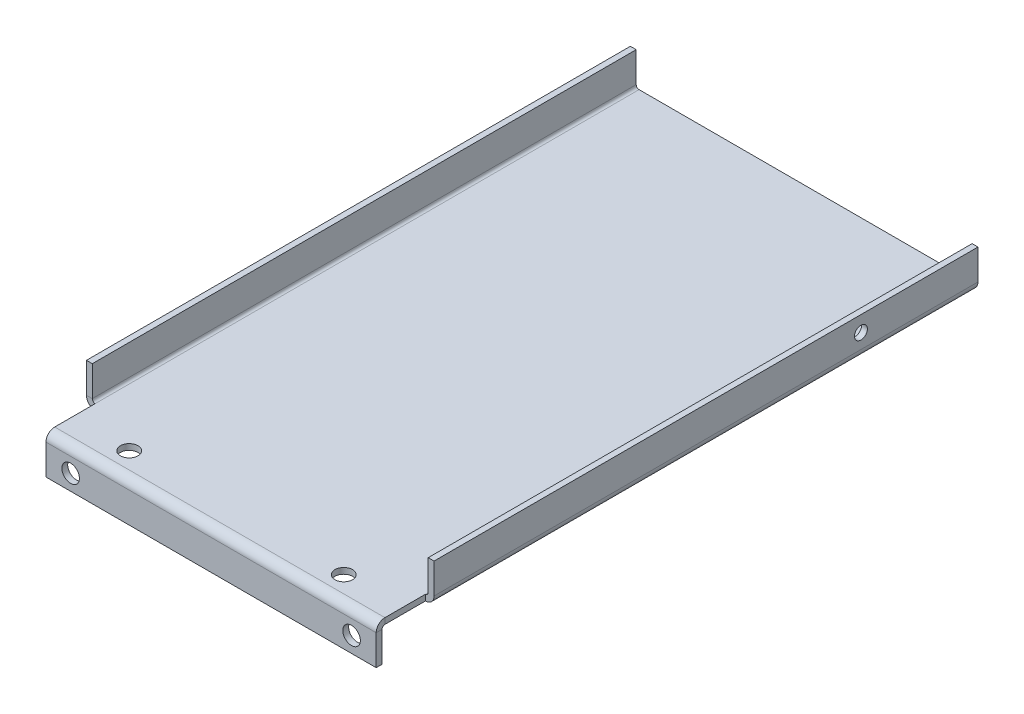
ISO-10303-21;
HEADER;
FILE_DESCRIPTION(('STEP AP214'),'2;1');
FILE_NAME('part.step','',(''),(''),'','','');
FILE_SCHEMA(('AUTOMOTIVE_DESIGN { 1 0 10303 214 1 1 1 1 }'));
ENDSEC;
DATA;
#1=APPLICATION_CONTEXT('core data for automotive mechanical design processes');
#2=APPLICATION_PROTOCOL_DEFINITION('international standard','automotive_design',2000,#1);
#3=PRODUCT_CONTEXT('',#1,'mechanical');
#4=PRODUCT('Part','Part','',(#3));
#5=PRODUCT_RELATED_PRODUCT_CATEGORY('part','',(#4));
#6=PRODUCT_DEFINITION_FORMATION('','',#4);
#7=PRODUCT_DEFINITION_CONTEXT('part definition',#1,'design');
#8=PRODUCT_DEFINITION('design','',#6,#7);
#9=PRODUCT_DEFINITION_SHAPE('','',#8);
#10=(LENGTH_UNIT() NAMED_UNIT(*) SI_UNIT(.MILLI.,.METRE.));
#11=(NAMED_UNIT(*) PLANE_ANGLE_UNIT() SI_UNIT($,.RADIAN.));
#12=(NAMED_UNIT(*) SI_UNIT($,.STERADIAN.) SOLID_ANGLE_UNIT());
#13=UNCERTAINTY_MEASURE_WITH_UNIT(LENGTH_MEASURE(1.E-05),#10,'distance_accuracy_value','');
#14=(GEOMETRIC_REPRESENTATION_CONTEXT(3) GLOBAL_UNCERTAINTY_ASSIGNED_CONTEXT((#13)) GLOBAL_UNIT_ASSIGNED_CONTEXT((#10,
#11,#12)) REPRESENTATION_CONTEXT('',''));
#15=CARTESIAN_POINT('',(0.,0.,0.));
#16=DIRECTION('',(0.,0.,1.));
#17=DIRECTION('',(1.,0.,0.));
#18=AXIS2_PLACEMENT_3D('',#15,#16,#17);
#19=CARTESIAN_POINT('',(0.,-1.5,152.));
#20=DIRECTION('',(0.,1.,0.));
#21=DIRECTION('',(0.,0.,1.));
#22=AXIS2_PLACEMENT_3D('',#19,#20,#21);
#23=PLANE('',#22);
#24=CARTESIAN_POINT('',(72.05,-1.5,145.5));
#25=DIRECTION('',(0.,-1.,0.));
#26=DIRECTION('',(0.,0.,1.));
#27=AXIS2_PLACEMENT_3D('',#24,#25,#26);
#28=CIRCLE('',#27,2.25);
#29=CARTESIAN_POINT('',(72.05,-1.5,147.75));
#30=VERTEX_POINT('',#29);
#31=EDGE_CURVE('E420',#30,#30,#28,.T.);
#32=ORIENTED_EDGE('',*,*,#31,.F.);
#33=EDGE_LOOP('',(#32));
#34=FACE_BOUND('',#33,.T.);
#35=CARTESIAN_POINT('',(17.05,-1.5,145.5));
#36=DIRECTION('',(0.,-1.,0.));
#37=DIRECTION('',(0.,0.,-1.));
#38=AXIS2_PLACEMENT_3D('',#35,#36,#37);
#39=CIRCLE('',#38,2.25);
#40=CARTESIAN_POINT('',(17.05,-1.5,143.25));
#41=VERTEX_POINT('',#40);
#42=EDGE_CURVE('E410',#41,#41,#39,.T.);
#43=ORIENTED_EDGE('',*,*,#42,.F.);
#44=EDGE_LOOP('',(#43));
#45=FACE_BOUND('',#44,.T.);
#46=DIRECTION('',(-1.,0.,0.));
#47=VECTOR('',#46,1.);
#48=CARTESIAN_POINT('',(2.23659999999999,-1.5,149.7634));
#49=LINE('',#48,#47);
#50=CARTESIAN_POINT('',(2.23659999999999,-1.5,149.7634));
#51=VERTEX_POINT('',#50);
#52=CARTESIAN_POINT('',(86.8634,-1.5,149.7634));
#53=VERTEX_POINT('',#52);
#54=EDGE_CURVE('E287',#51,#53,#49,.F.);
#55=ORIENTED_EDGE('',*,*,#54,.F.);
#56=DIRECTION('',(0.,0.,1.));
#57=VECTOR('',#56,1.);
#58=CARTESIAN_POINT('',(2.2366,-1.5,152.));
#59=LINE('',#58,#57);
#60=CARTESIAN_POINT('',(2.2366,-1.5,139.4));
#61=VERTEX_POINT('',#60);
#62=EDGE_CURVE('E380',#51,#61,#59,.F.);
#63=ORIENTED_EDGE('',*,*,#62,.T.);
#64=CARTESIAN_POINT('',(2.2366,-1.5,0.));
#65=VERTEX_POINT('',#64);
#66=EDGE_CURVE('E383',#61,#65,#59,.F.);
#67=ORIENTED_EDGE('',*,*,#66,.T.);
#68=DIRECTION('',(1.,0.,0.));
#69=VECTOR('',#68,1.);
#70=CARTESIAN_POINT('',(0.,-1.5,0.));
#71=LINE('',#70,#69);
#72=CARTESIAN_POINT('',(86.8634,-1.5,0.));
#73=VERTEX_POINT('',#72);
#74=EDGE_CURVE('E394',#65,#73,#71,.T.);
#75=ORIENTED_EDGE('',*,*,#74,.T.);
#76=DIRECTION('',(0.,0.,-1.));
#77=VECTOR('',#76,1.);
#78=CARTESIAN_POINT('',(86.8634,-1.5,0.));
#79=LINE('',#78,#77);
#80=CARTESIAN_POINT('',(86.8634,-1.5,139.4));
#81=VERTEX_POINT('',#80);
#82=EDGE_CURVE('E342',#73,#81,#79,.F.);
#83=ORIENTED_EDGE('',*,*,#82,.T.);
#84=DIRECTION('',(0.,0.,-1.));
#85=VECTOR('',#84,1.);
#86=CARTESIAN_POINT('',(86.8634,-1.5,152.));
#87=LINE('',#86,#85);
#88=EDGE_CURVE('E293',#53,#81,#87,.T.);
#89=ORIENTED_EDGE('',*,*,#88,.F.);
#90=EDGE_LOOP('',(#55,#63,#67,#75,#83,#89));
#91=FACE_BOUND('',#90,.T.);
#92=ADVANCED_FACE('F101',(#34,#45,#91),#23,.F.);
#93=CARTESIAN_POINT('',(0.,0.,152.));
#94=DIRECTION('',(0.,1.,0.));
#95=DIRECTION('',(0.,0.,1.));
#96=AXIS2_PLACEMENT_3D('',#93,#94,#95);
#97=PLANE('',#96);
#98=CARTESIAN_POINT('',(72.05,0.,145.5));
#99=DIRECTION('',(0.,1.,0.));
#100=DIRECTION('',(0.,0.,1.));
#101=AXIS2_PLACEMENT_3D('',#98,#99,#100);
#102=CIRCLE('',#101,2.25);
#103=CARTESIAN_POINT('',(72.05,0.,147.75));
#104=VERTEX_POINT('',#103);
#105=EDGE_CURVE('E104',#104,#104,#102,.T.);
#106=ORIENTED_EDGE('',*,*,#105,.F.);
#107=EDGE_LOOP('',(#106));
#108=FACE_BOUND('',#107,.T.);
#109=CARTESIAN_POINT('',(17.05,0.,145.5));
#110=DIRECTION('',(0.,1.,0.));
#111=DIRECTION('',(0.,0.,1.));
#112=AXIS2_PLACEMENT_3D('',#109,#110,#111);
#113=CIRCLE('',#112,2.25);
#114=CARTESIAN_POINT('',(17.05,0.,147.75));
#115=VERTEX_POINT('',#114);
#116=EDGE_CURVE('E408',#115,#115,#113,.T.);
#117=ORIENTED_EDGE('',*,*,#116,.F.);
#118=EDGE_LOOP('',(#117));
#119=FACE_BOUND('',#118,.T.);
#120=DIRECTION('',(0.,0.,1.));
#121=VECTOR('',#120,1.);
#122=CARTESIAN_POINT('',(2.2366,0.,152.));
#123=LINE('',#122,#121);
#124=CARTESIAN_POINT('',(2.23659999999999,0.,149.7634));
#125=VERTEX_POINT('',#124);
#126=CARTESIAN_POINT('',(2.2366,0.,139.4));
#127=VERTEX_POINT('',#126);
#128=EDGE_CURVE('E390',#125,#127,#123,.F.);
#129=ORIENTED_EDGE('',*,*,#128,.F.);
#130=DIRECTION('',(-1.,0.,0.));
#131=VECTOR('',#130,1.);
#132=CARTESIAN_POINT('',(2.23659999999999,0.,149.7634));
#133=LINE('',#132,#131);
#134=CARTESIAN_POINT('',(86.8634,0.,149.7634));
#135=VERTEX_POINT('',#134);
#136=EDGE_CURVE('E232',#125,#135,#133,.F.);
#137=ORIENTED_EDGE('',*,*,#136,.T.);
#138=DIRECTION('',(0.,0.,-1.));
#139=VECTOR('',#138,1.);
#140=CARTESIAN_POINT('',(86.8634,0.,0.));
#141=LINE('',#140,#139);
#142=CARTESIAN_POINT('',(86.8634,0.,139.4));
#143=VERTEX_POINT('',#142);
#144=EDGE_CURVE('E352',#143,#135,#141,.F.);
#145=ORIENTED_EDGE('',*,*,#144,.F.);
#146=CARTESIAN_POINT('',(86.8634,0.,0.));
#147=VERTEX_POINT('',#146);
#148=EDGE_CURVE('E349',#147,#143,#141,.F.);
#149=ORIENTED_EDGE('',*,*,#148,.F.);
#150=DIRECTION('',(1.,0.,0.));
#151=VECTOR('',#150,1.);
#152=CARTESIAN_POINT('',(0.,0.,0.));
#153=LINE('',#152,#151);
#154=CARTESIAN_POINT('',(2.2366,0.,0.));
#155=VERTEX_POINT('',#154);
#156=EDGE_CURVE('E396',#155,#147,#153,.T.);
#157=ORIENTED_EDGE('',*,*,#156,.F.);
#158=EDGE_CURVE('E361',#127,#155,#123,.F.);
#159=ORIENTED_EDGE('',*,*,#158,.F.);
#160=EDGE_LOOP('',(#129,#137,#145,#149,#157,#159));
#161=FACE_BOUND('',#160,.T.);
#162=ADVANCED_FACE('F495',(#108,#119,#161),#97,.T.);
#163=CARTESIAN_POINT('',(2.2366,8.50000000000001,152.));
#164=DIRECTION('',(1.,0.,0.));
#165=DIRECTION('',(0.,0.,-1.));
#166=AXIS2_PLACEMENT_3D('',#163,#164,#165);
#167=PLANE('',#166);
#168=DIRECTION('',(0.,1.,0.));
#169=VECTOR('',#168,1.);
#170=CARTESIAN_POINT('',(2.23659999999999,-1.5,149.7634));
#171=LINE('',#170,#169);
#172=EDGE_CURVE('E283',#51,#125,#171,.T.);
#173=ORIENTED_EDGE('',*,*,#172,.T.);
#174=ORIENTED_EDGE('',*,*,#128,.T.);
#175=DIRECTION('',(0.,-1.,0.));
#176=VECTOR('',#175,1.);
#177=CARTESIAN_POINT('',(2.2366,8.50000000000001,139.4));
#178=LINE('',#177,#176);
#179=EDGE_CURVE('E308',#127,#61,#178,.T.);
#180=ORIENTED_EDGE('',*,*,#179,.T.);
#181=ORIENTED_EDGE('',*,*,#62,.F.);
#182=EDGE_LOOP('',(#173,#174,#180,#181));
#183=FACE_BOUND('',#182,.T.);
#184=ADVANCED_FACE('F446',(#183),#167,.F.);
#185=CARTESIAN_POINT('',(86.8634,8.50000000000001,152.));
#186=DIRECTION('',(-1.,0.,0.));
#187=DIRECTION('',(0.,0.,1.));
#188=AXIS2_PLACEMENT_3D('',#185,#186,#187);
#189=PLANE('',#188);
#190=DIRECTION('',(0.,1.,0.));
#191=VECTOR('',#190,1.);
#192=CARTESIAN_POINT('',(86.8634,-1.5,149.7634));
#193=LINE('',#192,#191);
#194=EDGE_CURVE('E290',#53,#135,#193,.T.);
#195=ORIENTED_EDGE('',*,*,#194,.F.);
#196=ORIENTED_EDGE('',*,*,#88,.T.);
#197=DIRECTION('',(0.,-1.,0.));
#198=VECTOR('',#197,1.);
#199=CARTESIAN_POINT('',(86.8634,8.50000000000001,139.4));
#200=LINE('',#199,#198);
#201=EDGE_CURVE('E296',#143,#81,#200,.T.);
#202=ORIENTED_EDGE('',*,*,#201,.F.);
#203=ORIENTED_EDGE('',*,*,#144,.T.);
#204=EDGE_LOOP('',(#195,#196,#202,#203));
#205=FACE_BOUND('',#204,.T.);
#206=ADVANCED_FACE('F549',(#205),#189,.F.);
#207=CARTESIAN_POINT('',(2.2366,8.50000000000001,139.4));
#208=DIRECTION('',(0.,0.,-1.));
#209=DIRECTION('',(-1.,0.,0.));
#210=AXIS2_PLACEMENT_3D('',#207,#208,#209);
#211=PLANE('',#210);
#212=DIRECTION('',(0.,-1.,0.));
#213=VECTOR('',#212,1.);
#214=CARTESIAN_POINT('',(0.,0.,139.4));
#215=LINE('',#214,#213);
#216=CARTESIAN_POINT('',(0.,8.50000000000001,139.4));
#217=VERTEX_POINT('',#216);
#218=CARTESIAN_POINT('',(0.,0.736599999999992,139.4));
#219=VERTEX_POINT('',#218);
#220=EDGE_CURVE('E315',#217,#219,#215,.T.);
#221=ORIENTED_EDGE('',*,*,#220,.T.);
#222=DIRECTION('',(1.,0.,0.));
#223=VECTOR('',#222,1.);
#224=CARTESIAN_POINT('',(0.,0.736599999999992,139.4));
#225=LINE('',#224,#223);
#226=CARTESIAN_POINT('',(1.5,0.736599999999997,139.4));
#227=VERTEX_POINT('',#226);
#228=EDGE_CURVE('E13',#219,#227,#225,.T.);
#229=ORIENTED_EDGE('',*,*,#228,.T.);
#230=DIRECTION('',(0.,-1.,0.));
#231=VECTOR('',#230,1.);
#232=CARTESIAN_POINT('',(1.5,0.,139.4));
#233=LINE('',#232,#231);
#234=CARTESIAN_POINT('',(1.49999999999997,8.50000000000001,139.4));
#235=VERTEX_POINT('',#234);
#236=EDGE_CURVE('E124',#235,#227,#233,.T.);
#237=ORIENTED_EDGE('',*,*,#236,.F.);
#238=DIRECTION('',(-1.,0.,0.));
#239=VECTOR('',#238,1.);
#240=CARTESIAN_POINT('',(0.,8.5,139.4));
#241=LINE('',#240,#239);
#242=EDGE_CURVE('E399',#235,#217,#241,.T.);
#243=ORIENTED_EDGE('',*,*,#242,.T.);
#244=EDGE_LOOP('',(#221,#229,#237,#243));
#245=FACE_BOUND('',#244,.T.);
#246=ADVANCED_FACE('F482',(#245),#211,.F.);
#247=CARTESIAN_POINT('',(0.,0.,0.));
#248=DIRECTION('',(0.,0.,-1.));
#249=DIRECTION('',(-1.,0.,0.));
#250=AXIS2_PLACEMENT_3D('',#247,#248,#249);
#251=PLANE('',#250);
#252=ORIENTED_EDGE('',*,*,#156,.T.);
#253=DIRECTION('',(0.,-1.,0.));
#254=VECTOR('',#253,1.);
#255=CARTESIAN_POINT('',(86.8634,0.,0.));
#256=LINE('',#255,#254);
#257=EDGE_CURVE('E345',#147,#73,#256,.T.);
#258=ORIENTED_EDGE('',*,*,#257,.T.);
#259=ORIENTED_EDGE('',*,*,#74,.F.);
#260=DIRECTION('',(0.,-1.,0.));
#261=VECTOR('',#260,1.);
#262=CARTESIAN_POINT('',(2.2366,0.,0.));
#263=LINE('',#262,#261);
#264=EDGE_CURVE('E386',#155,#65,#263,.T.);
#265=ORIENTED_EDGE('',*,*,#264,.F.);
#266=EDGE_LOOP('',(#252,#258,#259,#265));
#267=FACE_BOUND('',#266,.T.);
#268=ADVANCED_FACE('F459',(#267),#251,.T.);
#269=CARTESIAN_POINT('',(2.2366,0.7366,0.));
#270=DIRECTION('',(0.,0.,-1.));
#271=DIRECTION('',(-1.,0.,0.));
#272=AXIS2_PLACEMENT_3D('',#269,#270,#271);
#273=PLANE('',#272);
#274=DIRECTION('',(-1.,0.,0.));
#275=VECTOR('',#274,1.);
#276=CARTESIAN_POINT('',(0.,0.736599999999992,0.));
#277=LINE('',#276,#275);
#278=CARTESIAN_POINT('',(1.5,0.736599999999997,0.));
#279=VERTEX_POINT('',#278);
#280=CARTESIAN_POINT('',(0.,0.736599999999992,0.));
#281=VERTEX_POINT('',#280);
#282=EDGE_CURVE('E357',#279,#281,#277,.T.);
#283=ORIENTED_EDGE('',*,*,#282,.F.);
#284=CARTESIAN_POINT('',(2.2366,0.7366,0.));
#285=DIRECTION('',(0.,0.,1.));
#286=DIRECTION('',(1.,0.,0.));
#287=AXIS2_PLACEMENT_3D('',#284,#285,#286);
#288=CIRCLE('',#287,0.7366);
#289=EDGE_CURVE('E387',#155,#279,#288,.F.);
#290=ORIENTED_EDGE('',*,*,#289,.F.);
#291=ORIENTED_EDGE('',*,*,#264,.T.);
#292=CARTESIAN_POINT('',(2.2366,0.7366,0.));
#293=DIRECTION('',(0.,0.,1.));
#294=DIRECTION('',(1.,0.,0.));
#295=AXIS2_PLACEMENT_3D('',#292,#293,#294);
#296=CIRCLE('',#295,2.2366);
#297=EDGE_CURVE('E382',#65,#281,#296,.F.);
#298=ORIENTED_EDGE('',*,*,#297,.T.);
#299=EDGE_LOOP('',(#283,#290,#291,#298));
#300=FACE_BOUND('',#299,.T.);
#301=ADVANCED_FACE('F465',(#300),#273,.T.);
#302=CARTESIAN_POINT('',(2.2366,0.7366,152.));
#303=DIRECTION('',(0.,0.,1.));
#304=DIRECTION('',(-1.,0.,0.));
#305=AXIS2_PLACEMENT_3D('',#302,#303,#304);
#306=CYLINDRICAL_SURFACE('',#305,2.2366);
#307=CARTESIAN_POINT('',(2.2366,0.7366,139.4));
#308=DIRECTION('',(0.,0.,-1.));
#309=DIRECTION('',(-1.,0.,0.));
#310=AXIS2_PLACEMENT_3D('',#307,#308,#309);
#311=CIRCLE('',#310,2.2366);
#312=EDGE_CURVE('E318',#219,#61,#311,.F.);
#313=ORIENTED_EDGE('',*,*,#312,.F.);
#314=DIRECTION('',(0.,0.,1.));
#315=VECTOR('',#314,1.);
#316=CARTESIAN_POINT('',(0.,0.736599999999992,0.));
#317=LINE('',#316,#315);
#318=EDGE_CURVE('E372',#281,#219,#317,.T.);
#319=ORIENTED_EDGE('',*,*,#318,.F.);
#320=ORIENTED_EDGE('',*,*,#297,.F.);
#321=ORIENTED_EDGE('',*,*,#66,.F.);
#322=EDGE_LOOP('',(#313,#319,#320,#321));
#323=FACE_BOUND('',#322,.T.);
#324=ADVANCED_FACE('F455',(#323),#306,.T.);
#325=CARTESIAN_POINT('',(2.2366,0.7366,152.));
#326=DIRECTION('',(0.,0.,1.));
#327=DIRECTION('',(-1.,0.,0.));
#328=AXIS2_PLACEMENT_3D('',#325,#326,#327);
#329=CYLINDRICAL_SURFACE('',#328,0.7366);
#330=DIRECTION('',(0.,0.,-1.));
#331=VECTOR('',#330,1.);
#332=CARTESIAN_POINT('',(1.5,0.736599999999997,0.));
#333=LINE('',#332,#331);
#334=EDGE_CURVE('E375',#279,#227,#333,.F.);
#335=ORIENTED_EDGE('',*,*,#334,.T.);
#336=CARTESIAN_POINT('',(2.2366,0.7366,139.4));
#337=DIRECTION('',(0.,0.,-1.));
#338=DIRECTION('',(-1.,0.,0.));
#339=AXIS2_PLACEMENT_3D('',#336,#337,#338);
#340=CIRCLE('',#339,0.7366);
#341=EDGE_CURVE('E312',#227,#127,#340,.F.);
#342=ORIENTED_EDGE('',*,*,#341,.T.);
#343=ORIENTED_EDGE('',*,*,#158,.T.);
#344=ORIENTED_EDGE('',*,*,#289,.T.);
#345=EDGE_LOOP('',(#335,#342,#343,#344));
#346=FACE_BOUND('',#345,.T.);
#347=ADVANCED_FACE('F468',(#346),#329,.F.);
#348=CARTESIAN_POINT('',(0.,8.5,0.));
#349=DIRECTION('',(0.,0.,-1.));
#350=DIRECTION('',(-1.,0.,0.));
#351=AXIS2_PLACEMENT_3D('',#348,#349,#350);
#352=PLANE('',#351);
#353=DIRECTION('',(0.,-1.,0.));
#354=VECTOR('',#353,1.);
#355=CARTESIAN_POINT('',(1.5,0.,0.));
#356=LINE('',#355,#354);
#357=CARTESIAN_POINT('',(1.49999999999997,8.50000000000001,0.));
#358=VERTEX_POINT('',#357);
#359=EDGE_CURVE('E370',#279,#358,#356,.F.);
#360=ORIENTED_EDGE('',*,*,#359,.F.);
#361=ORIENTED_EDGE('',*,*,#282,.T.);
#362=DIRECTION('',(0.,1.,0.));
#363=VECTOR('',#362,1.);
#364=CARTESIAN_POINT('',(0.,8.5,0.));
#365=LINE('',#364,#363);
#366=CARTESIAN_POINT('',(0.,8.5,0.));
#367=VERTEX_POINT('',#366);
#368=EDGE_CURVE('E365',#281,#367,#365,.T.);
#369=ORIENTED_EDGE('',*,*,#368,.T.);
#370=DIRECTION('',(1.,0.,0.));
#371=VECTOR('',#370,1.);
#372=CARTESIAN_POINT('',(0.,8.5,0.));
#373=LINE('',#372,#371);
#374=EDGE_CURVE('E358',#367,#358,#373,.T.);
#375=ORIENTED_EDGE('',*,*,#374,.T.);
#376=EDGE_LOOP('',(#360,#361,#369,#375));
#377=FACE_BOUND('',#376,.T.);
#378=ADVANCED_FACE('F474',(#377),#352,.T.);
#379=CARTESIAN_POINT('',(0.,0.,0.));
#380=DIRECTION('',(-1.,0.,0.));
#381=DIRECTION('',(0.,-1.,0.));
#382=AXIS2_PLACEMENT_3D('',#379,#380,#381);
#383=PLANE('',#382);
#384=ORIENTED_EDGE('',*,*,#220,.F.);
#385=DIRECTION('',(0.,0.,1.));
#386=VECTOR('',#385,1.);
#387=CARTESIAN_POINT('',(0.,8.5,152.));
#388=LINE('',#387,#386);
#389=EDGE_CURVE('E362',#367,#217,#388,.T.);
#390=ORIENTED_EDGE('',*,*,#389,.F.);
#391=ORIENTED_EDGE('',*,*,#368,.F.);
#392=ORIENTED_EDGE('',*,*,#318,.T.);
#393=EDGE_LOOP('',(#384,#390,#391,#392));
#394=FACE_BOUND('',#393,.T.);
#395=ADVANCED_FACE('F484',(#394),#383,.T.);
#396=CARTESIAN_POINT('',(1.5,0.,0.));
#397=DIRECTION('',(-1.,0.,0.));
#398=DIRECTION('',(0.,-1.,0.));
#399=AXIS2_PLACEMENT_3D('',#396,#397,#398);
#400=PLANE('',#399);
#401=DIRECTION('',(0.,0.,-1.));
#402=VECTOR('',#401,1.);
#403=CARTESIAN_POINT('',(1.49999999999997,8.50000000000001,0.));
#404=LINE('',#403,#402);
#405=EDGE_CURVE('E367',#358,#235,#404,.F.);
#406=ORIENTED_EDGE('',*,*,#405,.T.);
#407=ORIENTED_EDGE('',*,*,#236,.T.);
#408=ORIENTED_EDGE('',*,*,#334,.F.);
#409=ORIENTED_EDGE('',*,*,#359,.T.);
#410=EDGE_LOOP('',(#406,#407,#408,#409));
#411=FACE_BOUND('',#410,.T.);
#412=ADVANCED_FACE('F472',(#411),#400,.F.);
#413=CARTESIAN_POINT('',(0.,8.5,152.));
#414=DIRECTION('',(0.,1.,0.));
#415=DIRECTION('',(-1.,0.,0.));
#416=AXIS2_PLACEMENT_3D('',#413,#414,#415);
#417=PLANE('',#416);
#418=ORIENTED_EDGE('',*,*,#242,.F.);
#419=ORIENTED_EDGE('',*,*,#405,.F.);
#420=ORIENTED_EDGE('',*,*,#374,.F.);
#421=ORIENTED_EDGE('',*,*,#389,.T.);
#422=EDGE_LOOP('',(#418,#419,#420,#421));
#423=FACE_BOUND('',#422,.T.);
#424=ADVANCED_FACE('F480',(#423),#417,.T.);
#425=CARTESIAN_POINT('',(86.8634,0.736600000000006,0.));
#426=DIRECTION('',(0.,0.,1.));
#427=DIRECTION('',(1.,0.,0.));
#428=AXIS2_PLACEMENT_3D('',#425,#426,#427);
#429=PLANE('',#428);
#430=CARTESIAN_POINT('',(86.8634,0.736600000000006,0.));
#431=DIRECTION('',(0.,0.,-1.));
#432=DIRECTION('',(-1.,0.,0.));
#433=AXIS2_PLACEMENT_3D('',#430,#431,#432);
#434=CIRCLE('',#433,0.736600000000004);
#435=CARTESIAN_POINT('',(87.6,0.736600000000004,0.));
#436=VERTEX_POINT('',#435);
#437=EDGE_CURVE('E325',#436,#147,#434,.T.);
#438=ORIENTED_EDGE('',*,*,#437,.F.);
#439=DIRECTION('',(1.,0.,0.));
#440=VECTOR('',#439,1.);
#441=CARTESIAN_POINT('',(87.6,0.736600000000004,0.));
#442=LINE('',#441,#440);
#443=CARTESIAN_POINT('',(89.1,0.736599999999999,0.));
#444=VERTEX_POINT('',#443);
#445=EDGE_CURVE('E338',#436,#444,#442,.T.);
#446=ORIENTED_EDGE('',*,*,#445,.T.);
#447=CARTESIAN_POINT('',(86.8634,0.736600000000006,0.));
#448=DIRECTION('',(0.,0.,-1.));
#449=DIRECTION('',(-1.,0.,0.));
#450=AXIS2_PLACEMENT_3D('',#447,#448,#449);
#451=CIRCLE('',#450,2.2366);
#452=EDGE_CURVE('E346',#444,#73,#451,.T.);
#453=ORIENTED_EDGE('',*,*,#452,.T.);
#454=ORIENTED_EDGE('',*,*,#257,.F.);
#455=EDGE_LOOP('',(#438,#446,#453,#454));
#456=FACE_BOUND('',#455,.T.);
#457=ADVANCED_FACE('F533',(#456),#429,.F.);
#458=CARTESIAN_POINT('',(86.8634,0.736600000000006,0.));
#459=DIRECTION('',(0.,0.,-1.));
#460=DIRECTION('',(1.,0.,0.));
#461=AXIS2_PLACEMENT_3D('',#458,#459,#460);
#462=CYLINDRICAL_SURFACE('',#461,2.2366);
#463=CARTESIAN_POINT('',(86.8634,0.736600000000006,139.4));
#464=DIRECTION('',(0.,0.,-1.));
#465=DIRECTION('',(-1.,0.,0.));
#466=AXIS2_PLACEMENT_3D('',#463,#464,#465);
#467=CIRCLE('',#466,2.2366);
#468=CARTESIAN_POINT('',(89.1,0.736599999999999,139.4));
#469=VERTEX_POINT('',#468);
#470=EDGE_CURVE('E306',#81,#469,#467,.F.);
#471=ORIENTED_EDGE('',*,*,#470,.F.);
#472=ORIENTED_EDGE('',*,*,#82,.F.);
#473=ORIENTED_EDGE('',*,*,#452,.F.);
#474=DIRECTION('',(0.,0.,-1.));
#475=VECTOR('',#474,1.);
#476=CARTESIAN_POINT('',(89.1,0.736599999999999,0.));
#477=LINE('',#476,#475);
#478=EDGE_CURVE('E336',#469,#444,#477,.T.);
#479=ORIENTED_EDGE('',*,*,#478,.F.);
#480=EDGE_LOOP('',(#471,#472,#473,#479));
#481=FACE_BOUND('',#480,.T.);
#482=ADVANCED_FACE('F529',(#481),#462,.T.);
#483=CARTESIAN_POINT('',(86.8634,0.736600000000006,0.));
#484=DIRECTION('',(0.,0.,-1.));
#485=DIRECTION('',(1.,0.,0.));
#486=AXIS2_PLACEMENT_3D('',#483,#484,#485);
#487=CYLINDRICAL_SURFACE('',#486,0.736600000000004);
#488=ORIENTED_EDGE('',*,*,#148,.T.);
#489=CARTESIAN_POINT('',(86.8634,0.736600000000006,139.4));
#490=DIRECTION('',(0.,0.,-1.));
#491=DIRECTION('',(-1.,0.,0.));
#492=AXIS2_PLACEMENT_3D('',#489,#490,#491);
#493=CIRCLE('',#492,0.736600000000004);
#494=CARTESIAN_POINT('',(87.6,0.736600000000004,139.4));
#495=VERTEX_POINT('',#494);
#496=EDGE_CURVE('E302',#143,#495,#493,.F.);
#497=ORIENTED_EDGE('',*,*,#496,.T.);
#498=DIRECTION('',(0.,0.,1.));
#499=VECTOR('',#498,1.);
#500=CARTESIAN_POINT('',(87.6,0.736600000000004,152.));
#501=LINE('',#500,#499);
#502=EDGE_CURVE('E321',#495,#436,#501,.F.);
#503=ORIENTED_EDGE('',*,*,#502,.T.);
#504=ORIENTED_EDGE('',*,*,#437,.T.);
#505=EDGE_LOOP('',(#488,#497,#503,#504));
#506=FACE_BOUND('',#505,.T.);
#507=ADVANCED_FACE('F544',(#506),#487,.F.);
#508=CARTESIAN_POINT('',(89.1,0.,0.));
#509=DIRECTION('',(0.,0.,-1.));
#510=DIRECTION('',(-1.,0.,0.));
#511=AXIS2_PLACEMENT_3D('',#508,#509,#510);
#512=PLANE('',#511);
#513=DIRECTION('',(0.,-1.,0.));
#514=VECTOR('',#513,1.);
#515=CARTESIAN_POINT('',(89.1,0.,0.));
#516=LINE('',#515,#514);
#517=CARTESIAN_POINT('',(89.1,8.5,0.));
#518=VERTEX_POINT('',#517);
#519=EDGE_CURVE('E326',#518,#444,#516,.T.);
#520=ORIENTED_EDGE('',*,*,#519,.T.);
#521=ORIENTED_EDGE('',*,*,#445,.F.);
#522=DIRECTION('',(0.,1.,0.));
#523=VECTOR('',#522,1.);
#524=CARTESIAN_POINT('',(87.6,-2.90943739688533E-13,0.));
#525=LINE('',#524,#523);
#526=CARTESIAN_POINT('',(87.6,8.50000000000001,0.));
#527=VERTEX_POINT('',#526);
#528=EDGE_CURVE('E331',#527,#436,#525,.F.);
#529=ORIENTED_EDGE('',*,*,#528,.F.);
#530=DIRECTION('',(-1.,0.,0.));
#531=VECTOR('',#530,1.);
#532=CARTESIAN_POINT('',(89.1,8.5,0.));
#533=LINE('',#532,#531);
#534=EDGE_CURVE('E322',#518,#527,#533,.T.);
#535=ORIENTED_EDGE('',*,*,#534,.F.);
#536=EDGE_LOOP('',(#520,#521,#529,#535));
#537=FACE_BOUND('',#536,.T.);
#538=ADVANCED_FACE('F521',(#537),#512,.T.);
#539=CARTESIAN_POINT('',(89.1,-2.96180961696798E-13,0.));
#540=DIRECTION('',(1.,0.,0.));
#541=DIRECTION('',(0.,1.,0.));
#542=AXIS2_PLACEMENT_3D('',#539,#540,#541);
#543=PLANE('',#542);
#544=CARTESIAN_POINT('',(89.1,4.5,30.));
#545=DIRECTION('',(1.,0.,0.));
#546=DIRECTION('',(0.,0.,-1.));
#547=AXIS2_PLACEMENT_3D('',#544,#545,#546);
#548=CIRCLE('',#547,1.64999999999999);
#549=CARTESIAN_POINT('',(89.1,4.5,28.35));
#550=VERTEX_POINT('',#549);
#551=EDGE_CURVE('E507',#550,#550,#548,.T.);
#552=ORIENTED_EDGE('',*,*,#551,.F.);
#553=EDGE_LOOP('',(#552));
#554=FACE_BOUND('',#553,.T.);
#555=DIRECTION('',(0.,1.,0.));
#556=VECTOR('',#555,1.);
#557=CARTESIAN_POINT('',(89.1,-2.96180961696798E-13,139.4));
#558=LINE('',#557,#556);
#559=CARTESIAN_POINT('',(89.1,8.5,139.4));
#560=VERTEX_POINT('',#559);
#561=EDGE_CURVE('E117',#469,#560,#558,.T.);
#562=ORIENTED_EDGE('',*,*,#561,.F.);
#563=ORIENTED_EDGE('',*,*,#478,.T.);
#564=ORIENTED_EDGE('',*,*,#519,.F.);
#565=DIRECTION('',(0.,0.,-1.));
#566=VECTOR('',#565,1.);
#567=CARTESIAN_POINT('',(89.1,8.5,0.));
#568=LINE('',#567,#566);
#569=EDGE_CURVE('E329',#560,#518,#568,.T.);
#570=ORIENTED_EDGE('',*,*,#569,.F.);
#571=EDGE_LOOP('',(#562,#563,#564,#570));
#572=FACE_BOUND('',#571,.T.);
#573=ADVANCED_FACE('F517',(#554,#572),#543,.T.);
#574=CARTESIAN_POINT('',(87.6,-2.90943739688533E-13,0.));
#575=DIRECTION('',(1.,0.,0.));
#576=DIRECTION('',(0.,1.,0.));
#577=AXIS2_PLACEMENT_3D('',#574,#575,#576);
#578=PLANE('',#577);
#579=CARTESIAN_POINT('',(87.6,4.5,30.));
#580=DIRECTION('',(1.,0.,0.));
#581=DIRECTION('',(0.,1.,0.));
#582=AXIS2_PLACEMENT_3D('',#579,#580,#581);
#583=CIRCLE('',#582,1.64999999999999);
#584=CARTESIAN_POINT('',(87.6,6.14999999999999,30.));
#585=VERTEX_POINT('',#584);
#586=EDGE_CURVE('E505',#585,#585,#583,.T.);
#587=ORIENTED_EDGE('',*,*,#586,.T.);
#588=EDGE_LOOP('',(#587));
#589=FACE_BOUND('',#588,.T.);
#590=ORIENTED_EDGE('',*,*,#502,.F.);
#591=DIRECTION('',(0.,1.,0.));
#592=VECTOR('',#591,1.);
#593=CARTESIAN_POINT('',(87.6,-2.90943739688533E-13,139.4));
#594=LINE('',#593,#592);
#595=CARTESIAN_POINT('',(87.6,8.50000000000001,139.4));
#596=VERTEX_POINT('',#595);
#597=EDGE_CURVE('E299',#495,#596,#594,.T.);
#598=ORIENTED_EDGE('',*,*,#597,.T.);
#599=DIRECTION('',(0.,0.,1.));
#600=VECTOR('',#599,1.);
#601=CARTESIAN_POINT('',(87.6,8.50000000000001,0.));
#602=LINE('',#601,#600);
#603=EDGE_CURVE('E334',#596,#527,#602,.F.);
#604=ORIENTED_EDGE('',*,*,#603,.T.);
#605=ORIENTED_EDGE('',*,*,#528,.T.);
#606=EDGE_LOOP('',(#590,#598,#604,#605));
#607=FACE_BOUND('',#606,.T.);
#608=ADVANCED_FACE('F520',(#589,#607),#578,.F.);
#609=CARTESIAN_POINT('',(89.1,8.5,0.));
#610=DIRECTION('',(0.,1.,0.));
#611=DIRECTION('',(-1.,0.,0.));
#612=AXIS2_PLACEMENT_3D('',#609,#610,#611);
#613=PLANE('',#612);
#614=DIRECTION('',(-1.,0.,0.));
#615=VECTOR('',#614,1.);
#616=CARTESIAN_POINT('',(89.1,8.5,139.4));
#617=LINE('',#616,#615);
#618=EDGE_CURVE('E109',#560,#596,#617,.T.);
#619=ORIENTED_EDGE('',*,*,#618,.F.);
#620=ORIENTED_EDGE('',*,*,#569,.T.);
#621=ORIENTED_EDGE('',*,*,#534,.T.);
#622=ORIENTED_EDGE('',*,*,#603,.F.);
#623=EDGE_LOOP('',(#619,#620,#621,#622));
#624=FACE_BOUND('',#623,.T.);
#625=ADVANCED_FACE('F539',(#624),#613,.T.);
#626=ORIENTED_EDGE('',*,*,#228,.F.);
#627=ORIENTED_EDGE('',*,*,#312,.T.);
#628=ORIENTED_EDGE('',*,*,#179,.F.);
#629=ORIENTED_EDGE('',*,*,#341,.F.);
#630=EDGE_LOOP('',(#626,#627,#628,#629));
#631=FACE_BOUND('',#630,.T.);
#632=ADVANCED_FACE('F558',(#631),#211,.F.);
#633=CARTESIAN_POINT('',(86.8634,8.50000000000001,139.4));
#634=DIRECTION('',(0.,0.,-1.));
#635=DIRECTION('',(-1.,0.,0.));
#636=AXIS2_PLACEMENT_3D('',#633,#634,#635);
#637=PLANE('',#636);
#638=ORIENTED_EDGE('',*,*,#470,.T.);
#639=ORIENTED_EDGE('',*,*,#561,.T.);
#640=ORIENTED_EDGE('',*,*,#618,.T.);
#641=ORIENTED_EDGE('',*,*,#597,.F.);
#642=ORIENTED_EDGE('',*,*,#496,.F.);
#643=ORIENTED_EDGE('',*,*,#201,.T.);
#644=EDGE_LOOP('',(#638,#639,#640,#641,#642,#643));
#645=FACE_BOUND('',#644,.T.);
#646=ADVANCED_FACE('F540',(#645),#637,.F.);
#647=CARTESIAN_POINT('',(86.8634,-2.23660000000001,149.7634));
#648=DIRECTION('',(1.,0.,0.));
#649=DIRECTION('',(0.,0.,-1.));
#650=AXIS2_PLACEMENT_3D('',#647,#648,#649);
#651=PLANE('',#650);
#652=DIRECTION('',(0.,0.,1.));
#653=VECTOR('',#652,1.);
#654=CARTESIAN_POINT('',(86.8634,-2.23660000000001,152.));
#655=LINE('',#654,#653);
#656=CARTESIAN_POINT('',(86.8634,-2.2366,150.5));
#657=VERTEX_POINT('',#656);
#658=CARTESIAN_POINT('',(86.8634,-2.2366,152.));
#659=VERTEX_POINT('',#658);
#660=EDGE_CURVE('E277',#657,#659,#655,.T.);
#661=ORIENTED_EDGE('',*,*,#660,.F.);
#662=CARTESIAN_POINT('',(86.8634,-2.23660000000001,149.7634));
#663=DIRECTION('',(-1.,0.,0.));
#664=DIRECTION('',(0.,0.,1.));
#665=AXIS2_PLACEMENT_3D('',#662,#663,#664);
#666=CIRCLE('',#665,0.736600000000004);
#667=EDGE_CURVE('E235',#53,#657,#666,.F.);
#668=ORIENTED_EDGE('',*,*,#667,.F.);
#669=ORIENTED_EDGE('',*,*,#194,.T.);
#670=CARTESIAN_POINT('',(86.8634,-2.23660000000001,149.7634));
#671=DIRECTION('',(-1.,0.,0.));
#672=DIRECTION('',(0.,0.,1.));
#673=AXIS2_PLACEMENT_3D('',#670,#671,#672);
#674=CIRCLE('',#673,2.2366);
#675=EDGE_CURVE('E282',#135,#659,#674,.F.);
#676=ORIENTED_EDGE('',*,*,#675,.T.);
#677=EDGE_LOOP('',(#661,#668,#669,#676));
#678=FACE_BOUND('',#677,.T.);
#679=ADVANCED_FACE('F437',(#678),#651,.T.);
#680=CARTESIAN_POINT('',(2.23659999999999,-2.23660000000001,149.7634));
#681=DIRECTION('',(1.,0.,0.));
#682=DIRECTION('',(0.,0.,-1.));
#683=AXIS2_PLACEMENT_3D('',#680,#681,#682);
#684=PLANE('',#683);
#685=CARTESIAN_POINT('',(2.23659999999999,-2.23660000000001,149.7634));
#686=DIRECTION('',(-1.,0.,0.));
#687=DIRECTION('',(0.,0.,1.));
#688=AXIS2_PLACEMENT_3D('',#685,#686,#687);
#689=CIRCLE('',#688,0.736600000000004);
#690=CARTESIAN_POINT('',(2.23659999999999,-2.2366,150.5));
#691=VERTEX_POINT('',#690);
#692=EDGE_CURVE('E242',#691,#51,#689,.T.);
#693=ORIENTED_EDGE('',*,*,#692,.F.);
#694=DIRECTION('',(0.,0.,1.));
#695=VECTOR('',#694,1.);
#696=CARTESIAN_POINT('',(2.23659999999999,-2.23660000000001,150.5));
#697=LINE('',#696,#695);
#698=CARTESIAN_POINT('',(2.23659999999999,-2.23660000000001,152.));
#699=VERTEX_POINT('',#698);
#700=EDGE_CURVE('E239',#691,#699,#697,.T.);
#701=ORIENTED_EDGE('',*,*,#700,.T.);
#702=CARTESIAN_POINT('',(2.23659999999999,-2.23660000000001,149.7634));
#703=DIRECTION('',(-1.,0.,0.));
#704=DIRECTION('',(0.,0.,1.));
#705=AXIS2_PLACEMENT_3D('',#702,#703,#704);
#706=CIRCLE('',#705,2.2366);
#707=EDGE_CURVE('E225',#699,#125,#706,.T.);
#708=ORIENTED_EDGE('',*,*,#707,.T.);
#709=ORIENTED_EDGE('',*,*,#172,.F.);
#710=EDGE_LOOP('',(#693,#701,#708,#709));
#711=FACE_BOUND('',#710,.T.);
#712=ADVANCED_FACE('F240',(#711),#684,.F.);
#713=CARTESIAN_POINT('',(2.23659999999999,-2.23660000000001,149.7634));
#714=DIRECTION('',(-1.,0.,0.));
#715=DIRECTION('',(0.,0.,1.));
#716=AXIS2_PLACEMENT_3D('',#713,#714,#715);
#717=CYLINDRICAL_SURFACE('',#716,2.2366);
#718=ORIENTED_EDGE('',*,*,#136,.F.);
#719=ORIENTED_EDGE('',*,*,#707,.F.);
#720=DIRECTION('',(-1.,0.,0.));
#721=VECTOR('',#720,1.);
#722=CARTESIAN_POINT('',(0.,-2.23660000000001,152.));
#723=LINE('',#722,#721);
#724=EDGE_CURVE('E229',#659,#699,#723,.T.);
#725=ORIENTED_EDGE('',*,*,#724,.F.);
#726=ORIENTED_EDGE('',*,*,#675,.F.);
#727=EDGE_LOOP('',(#718,#719,#725,#726));
#728=FACE_BOUND('',#727,.T.);
#729=ADVANCED_FACE('F227',(#728),#717,.T.);
#730=CARTESIAN_POINT('',(2.23659999999999,-2.23660000000001,149.7634));
#731=DIRECTION('',(-1.,0.,0.));
#732=DIRECTION('',(0.,0.,1.));
#733=AXIS2_PLACEMENT_3D('',#730,#731,#732);
#734=CYLINDRICAL_SURFACE('',#733,0.736600000000004);
#735=ORIENTED_EDGE('',*,*,#54,.T.);
#736=ORIENTED_EDGE('',*,*,#667,.T.);
#737=DIRECTION('',(1.,0.,0.));
#738=VECTOR('',#737,1.);
#739=CARTESIAN_POINT('',(86.8634,-2.23660000000001,150.5));
#740=LINE('',#739,#738);
#741=EDGE_CURVE('E247',#657,#691,#740,.F.);
#742=ORIENTED_EDGE('',*,*,#741,.T.);
#743=ORIENTED_EDGE('',*,*,#692,.T.);
#744=EDGE_LOOP('',(#735,#736,#742,#743));
#745=FACE_BOUND('',#744,.T.);
#746=ADVANCED_FACE('F440',(#745),#734,.F.);
#747=CARTESIAN_POINT('',(2.2366,-1.49999999999999,152.));
#748=DIRECTION('',(-1.,0.,0.));
#749=DIRECTION('',(0.,0.,1.));
#750=AXIS2_PLACEMENT_3D('',#747,#748,#749);
#751=PLANE('',#750);
#752=DIRECTION('',(0.,1.,0.));
#753=VECTOR('',#752,1.);
#754=CARTESIAN_POINT('',(2.2366,-1.49999999999999,152.));
#755=LINE('',#754,#753);
#756=CARTESIAN_POINT('',(2.2366,-10.,152.));
#757=VERTEX_POINT('',#756);
#758=EDGE_CURVE('E254',#757,#699,#755,.T.);
#759=ORIENTED_EDGE('',*,*,#758,.T.);
#760=ORIENTED_EDGE('',*,*,#700,.F.);
#761=DIRECTION('',(0.,-1.,0.));
#762=VECTOR('',#761,1.);
#763=CARTESIAN_POINT('',(2.2366,4.96334999244187E-13,150.5));
#764=LINE('',#763,#762);
#765=CARTESIAN_POINT('',(2.2366,-10.,150.5));
#766=VERTEX_POINT('',#765);
#767=EDGE_CURVE('E270',#766,#691,#764,.F.);
#768=ORIENTED_EDGE('',*,*,#767,.F.);
#769=DIRECTION('',(0.,0.,-1.));
#770=VECTOR('',#769,1.);
#771=CARTESIAN_POINT('',(2.2366,-10.,152.));
#772=LINE('',#771,#770);
#773=EDGE_CURVE('E259',#757,#766,#772,.T.);
#774=ORIENTED_EDGE('',*,*,#773,.F.);
#775=EDGE_LOOP('',(#759,#760,#768,#774));
#776=FACE_BOUND('',#775,.T.);
#777=ADVANCED_FACE('F258',(#776),#751,.T.);
#778=CARTESIAN_POINT('',(86.8634,-10.,152.));
#779=DIRECTION('',(1.,0.,0.));
#780=DIRECTION('',(0.,0.,-1.));
#781=AXIS2_PLACEMENT_3D('',#778,#779,#780);
#782=PLANE('',#781);
#783=DIRECTION('',(0.,1.,0.));
#784=VECTOR('',#783,1.);
#785=CARTESIAN_POINT('',(86.8634,4.96334999244187E-13,150.5));
#786=LINE('',#785,#784);
#787=CARTESIAN_POINT('',(86.8634,-10.,150.5));
#788=VERTEX_POINT('',#787);
#789=EDGE_CURVE('E256',#657,#788,#786,.F.);
#790=ORIENTED_EDGE('',*,*,#789,.F.);
#791=ORIENTED_EDGE('',*,*,#660,.T.);
#792=DIRECTION('',(0.,-1.,0.));
#793=VECTOR('',#792,1.);
#794=CARTESIAN_POINT('',(86.8634,-10.,152.));
#795=LINE('',#794,#793);
#796=CARTESIAN_POINT('',(86.8634,-10.,152.));
#797=VERTEX_POINT('',#796);
#798=EDGE_CURVE('E255',#659,#797,#795,.T.);
#799=ORIENTED_EDGE('',*,*,#798,.T.);
#800=DIRECTION('',(0.,0.,-1.));
#801=VECTOR('',#800,1.);
#802=CARTESIAN_POINT('',(86.8634,-10.,152.));
#803=LINE('',#802,#801);
#804=EDGE_CURVE('E261',#797,#788,#803,.T.);
#805=ORIENTED_EDGE('',*,*,#804,.T.);
#806=EDGE_LOOP('',(#790,#791,#799,#805));
#807=FACE_BOUND('',#806,.T.);
#808=ADVANCED_FACE('F434',(#807),#782,.T.);
#809=CARTESIAN_POINT('',(0.,5.01572221252452E-13,152.));
#810=DIRECTION('',(0.,0.,1.));
#811=DIRECTION('',(0.,-1.,0.));
#812=AXIS2_PLACEMENT_3D('',#809,#810,#811);
#813=PLANE('',#812);
#814=CARTESIAN_POINT('',(8.55,-5.99999999999999,152.));
#815=DIRECTION('',(0.,0.,1.));
#816=DIRECTION('',(-1.,0.,0.));
#817=AXIS2_PLACEMENT_3D('',#814,#815,#816);
#818=CIRCLE('',#817,2.25);
#819=CARTESIAN_POINT('',(6.3,-5.99999999999999,152.));
#820=VERTEX_POINT('',#819);
#821=EDGE_CURVE('E407',#820,#820,#818,.T.);
#822=ORIENTED_EDGE('',*,*,#821,.F.);
#823=EDGE_LOOP('',(#822));
#824=FACE_BOUND('',#823,.T.);
#825=CARTESIAN_POINT('',(80.55,-5.99999999999999,152.));
#826=DIRECTION('',(0.,0.,1.));
#827=DIRECTION('',(1.,0.,0.));
#828=AXIS2_PLACEMENT_3D('',#825,#826,#827);
#829=CIRCLE('',#828,2.25);
#830=CARTESIAN_POINT('',(82.8,-5.99999999999999,152.));
#831=VERTEX_POINT('',#830);
#832=EDGE_CURVE('E404',#831,#831,#829,.T.);
#833=ORIENTED_EDGE('',*,*,#832,.F.);
#834=EDGE_LOOP('',(#833));
#835=FACE_BOUND('',#834,.T.);
#836=ORIENTED_EDGE('',*,*,#798,.F.);
#837=ORIENTED_EDGE('',*,*,#724,.T.);
#838=ORIENTED_EDGE('',*,*,#758,.F.);
#839=DIRECTION('',(-1.,0.,0.));
#840=VECTOR('',#839,1.);
#841=CARTESIAN_POINT('',(2.2366,-10.,152.));
#842=LINE('',#841,#840);
#843=EDGE_CURVE('E262',#797,#757,#842,.T.);
#844=ORIENTED_EDGE('',*,*,#843,.F.);
#845=EDGE_LOOP('',(#836,#837,#838,#844));
#846=FACE_BOUND('',#845,.T.);
#847=ADVANCED_FACE('F252',(#824,#835,#846),#813,.T.);
#848=CARTESIAN_POINT('',(0.,4.96334999244187E-13,150.5));
#849=DIRECTION('',(0.,0.,1.));
#850=DIRECTION('',(0.,-1.,0.));
#851=AXIS2_PLACEMENT_3D('',#848,#849,#850);
#852=PLANE('',#851);
#853=CARTESIAN_POINT('',(8.55,-5.99999999999999,150.5));
#854=DIRECTION('',(0.,0.,1.));
#855=DIRECTION('',(0.,-1.,0.));
#856=AXIS2_PLACEMENT_3D('',#853,#854,#855);
#857=CIRCLE('',#856,2.25);
#858=CARTESIAN_POINT('',(8.55,-8.24999999999999,150.5));
#859=VERTEX_POINT('',#858);
#860=EDGE_CURVE('E405',#859,#859,#857,.T.);
#861=ORIENTED_EDGE('',*,*,#860,.T.);
#862=EDGE_LOOP('',(#861));
#863=FACE_BOUND('',#862,.T.);
#864=CARTESIAN_POINT('',(80.55,-5.99999999999999,150.5));
#865=DIRECTION('',(0.,0.,1.));
#866=DIRECTION('',(0.,-1.,0.));
#867=AXIS2_PLACEMENT_3D('',#864,#865,#866);
#868=CIRCLE('',#867,2.25);
#869=CARTESIAN_POINT('',(80.55,-8.24999999999998,150.5));
#870=VERTEX_POINT('',#869);
#871=EDGE_CURVE('E280',#870,#870,#868,.T.);
#872=ORIENTED_EDGE('',*,*,#871,.T.);
#873=EDGE_LOOP('',(#872));
#874=FACE_BOUND('',#873,.T.);
#875=ORIENTED_EDGE('',*,*,#741,.F.);
#876=ORIENTED_EDGE('',*,*,#789,.T.);
#877=DIRECTION('',(1.,0.,0.));
#878=VECTOR('',#877,1.);
#879=CARTESIAN_POINT('',(0.,-10.,150.5));
#880=LINE('',#879,#878);
#881=EDGE_CURVE('E272',#788,#766,#880,.F.);
#882=ORIENTED_EDGE('',*,*,#881,.T.);
#883=ORIENTED_EDGE('',*,*,#767,.T.);
#884=EDGE_LOOP('',(#875,#876,#882,#883));
#885=FACE_BOUND('',#884,.T.);
#886=ADVANCED_FACE('F431',(#863,#874,#885),#852,.F.);
#887=CARTESIAN_POINT('',(2.2366,-10.,152.));
#888=DIRECTION('',(0.,-1.,0.));
#889=DIRECTION('',(0.,0.,-1.));
#890=AXIS2_PLACEMENT_3D('',#887,#888,#889);
#891=PLANE('',#890);
#892=ORIENTED_EDGE('',*,*,#881,.F.);
#893=ORIENTED_EDGE('',*,*,#804,.F.);
#894=ORIENTED_EDGE('',*,*,#843,.T.);
#895=ORIENTED_EDGE('',*,*,#773,.T.);
#896=EDGE_LOOP('',(#892,#893,#894,#895));
#897=FACE_BOUND('',#896,.T.);
#898=ADVANCED_FACE('F427',(#897),#891,.T.);
#899=CARTESIAN_POINT('',(80.55,-5.99999999999999,142.));
#900=DIRECTION('',(0.,0.,1.));
#901=DIRECTION('',(1.,0.,0.));
#902=AXIS2_PLACEMENT_3D('',#899,#900,#901);
#903=CYLINDRICAL_SURFACE('',#902,2.25);
#904=ORIENTED_EDGE('',*,*,#832,.T.);
#905=EDGE_LOOP('',(#904));
#906=FACE_BOUND('',#905,.T.);
#907=ORIENTED_EDGE('',*,*,#871,.F.);
#908=EDGE_LOOP('',(#907));
#909=FACE_BOUND('',#908,.T.);
#910=ADVANCED_FACE('F814',(#906,#909),#903,.F.);
#911=CARTESIAN_POINT('',(8.55,-5.99999999999999,142.));
#912=DIRECTION('',(0.,0.,1.));
#913=DIRECTION('',(1.,0.,0.));
#914=AXIS2_PLACEMENT_3D('',#911,#912,#913);
#915=CYLINDRICAL_SURFACE('',#914,2.25);
#916=ORIENTED_EDGE('',*,*,#821,.T.);
#917=EDGE_LOOP('',(#916));
#918=FACE_BOUND('',#917,.T.);
#919=ORIENTED_EDGE('',*,*,#860,.F.);
#920=EDGE_LOOP('',(#919));
#921=FACE_BOUND('',#920,.T.);
#922=ADVANCED_FACE('F823',(#918,#921),#915,.F.);
#923=CARTESIAN_POINT('',(17.05,8.5,145.5));
#924=DIRECTION('',(0.,-1.,0.));
#925=DIRECTION('',(0.,0.,-1.));
#926=AXIS2_PLACEMENT_3D('',#923,#924,#925);
#927=CYLINDRICAL_SURFACE('',#926,2.25);
#928=ORIENTED_EDGE('',*,*,#116,.T.);
#929=EDGE_LOOP('',(#928));
#930=FACE_BOUND('',#929,.T.);
#931=ORIENTED_EDGE('',*,*,#42,.T.);
#932=EDGE_LOOP('',(#931));
#933=FACE_BOUND('',#932,.T.);
#934=ADVANCED_FACE('F834',(#930,#933),#927,.F.);
#935=CARTESIAN_POINT('',(72.05,8.5,145.5));
#936=DIRECTION('',(0.,-1.,0.));
#937=DIRECTION('',(0.,0.,-1.));
#938=AXIS2_PLACEMENT_3D('',#935,#936,#937);
#939=CYLINDRICAL_SURFACE('',#938,2.25);
#940=ORIENTED_EDGE('',*,*,#105,.T.);
#941=EDGE_LOOP('',(#940));
#942=FACE_BOUND('',#941,.T.);
#943=ORIENTED_EDGE('',*,*,#31,.T.);
#944=EDGE_LOOP('',(#943));
#945=FACE_BOUND('',#944,.T.);
#946=ADVANCED_FACE('F845',(#942,#945),#939,.F.);
#947=CARTESIAN_POINT('',(89.1,4.5,30.));
#948=DIRECTION('',(1.,0.,0.));
#949=DIRECTION('',(0.,0.,-1.));
#950=AXIS2_PLACEMENT_3D('',#947,#948,#949);
#951=CYLINDRICAL_SURFACE('',#950,1.64999999999999);
#952=ORIENTED_EDGE('',*,*,#551,.T.);
#953=EDGE_LOOP('',(#952));
#954=FACE_BOUND('',#953,.T.);
#955=ORIENTED_EDGE('',*,*,#586,.F.);
#956=EDGE_LOOP('',(#955));
#957=FACE_BOUND('',#956,.T.);
#958=ADVANCED_FACE('F514',(#954,#957),#951,.F.);
#959=CLOSED_SHELL('',(#92,#162,#184,#206,#246,#268,#301,#324,#347,#378,#395,#412,#424,#457,#482,
#507,#538,#573,#608,#625,#632,#646,#679,#712,#729,#746,#777,#808,#847,#886,#898,#910,#922,#934,
#946,#958));
#960=MANIFOLD_SOLID_BREP('B2',#959);
#961=ADVANCED_BREP_SHAPE_REPRESENTATION('',(#18,#960),#14);
#962=SHAPE_DEFINITION_REPRESENTATION(#9,#961);
ENDSEC;
END-ISO-10303-21;
